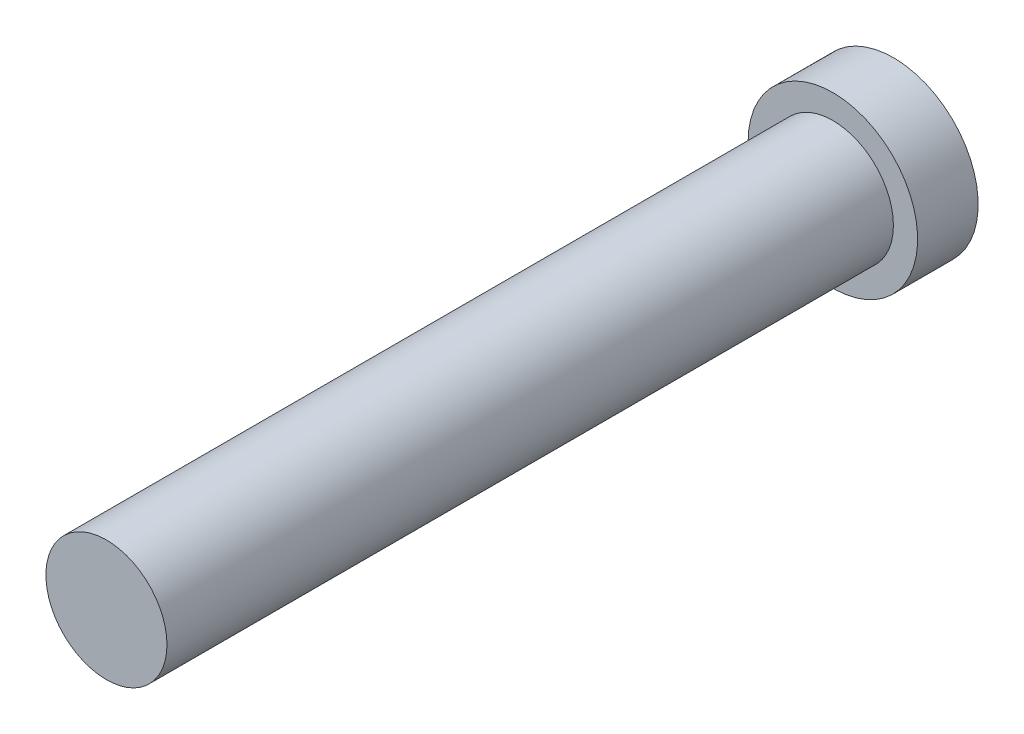
ISO-10303-21;
HEADER;
FILE_DESCRIPTION(('STEP AP214'),'2;1');
FILE_NAME('part.step','',(''),(''),'','','');
FILE_SCHEMA(('AUTOMOTIVE_DESIGN { 1 0 10303 214 1 1 1 1 }'));
ENDSEC;
DATA;
#1=APPLICATION_CONTEXT('core data for automotive mechanical design processes');
#2=APPLICATION_PROTOCOL_DEFINITION('international standard','automotive_design',2000,#1);
#3=PRODUCT_CONTEXT('',#1,'mechanical');
#4=PRODUCT('Part','Part','',(#3));
#5=PRODUCT_RELATED_PRODUCT_CATEGORY('part','',(#4));
#6=PRODUCT_DEFINITION_FORMATION('','',#4);
#7=PRODUCT_DEFINITION_CONTEXT('part definition',#1,'design');
#8=PRODUCT_DEFINITION('design','',#6,#7);
#9=PRODUCT_DEFINITION_SHAPE('','',#8);
#10=(LENGTH_UNIT() NAMED_UNIT(*) SI_UNIT(.MILLI.,.METRE.));
#11=(NAMED_UNIT(*) PLANE_ANGLE_UNIT() SI_UNIT($,.RADIAN.));
#12=(NAMED_UNIT(*) SI_UNIT($,.STERADIAN.) SOLID_ANGLE_UNIT());
#13=UNCERTAINTY_MEASURE_WITH_UNIT(LENGTH_MEASURE(1.E-05),#10,'distance_accuracy_value','');
#14=(GEOMETRIC_REPRESENTATION_CONTEXT(3) GLOBAL_UNCERTAINTY_ASSIGNED_CONTEXT((#13)) GLOBAL_UNIT_ASSIGNED_CONTEXT((#10,
#11,#12)) REPRESENTATION_CONTEXT('',''));
#15=CARTESIAN_POINT('',(0.,0.,0.));
#16=DIRECTION('',(0.,0.,1.));
#17=DIRECTION('',(1.,0.,0.));
#18=AXIS2_PLACEMENT_3D('',#15,#16,#17);
#19=CARTESIAN_POINT('',(0.,0.,30.));
#20=DIRECTION('',(0.,0.,-1.));
#21=DIRECTION('',(-1.,0.,0.));
#22=AXIS2_PLACEMENT_3D('',#19,#20,#21);
#23=CYLINDRICAL_SURFACE('',#22,2.5);
#24=CARTESIAN_POINT('',(0.,0.,30.));
#25=DIRECTION('',(0.,0.,1.));
#26=DIRECTION('',(1.,0.,0.));
#27=AXIS2_PLACEMENT_3D('',#24,#25,#26);
#28=CIRCLE('',#27,2.5);
#29=CARTESIAN_POINT('',(2.5,0.,30.));
#30=VERTEX_POINT('',#29);
#31=EDGE_CURVE('E10',#30,#30,#28,.T.);
#32=ORIENTED_EDGE('',*,*,#31,.F.);
#33=EDGE_LOOP('',(#32));
#34=FACE_BOUND('',#33,.T.);
#35=CARTESIAN_POINT('',(0.,0.,0.));
#36=DIRECTION('',(0.,0.,1.));
#37=DIRECTION('',(1.,0.,0.));
#38=AXIS2_PLACEMENT_3D('',#35,#36,#37);
#39=CIRCLE('',#38,2.5);
#40=CARTESIAN_POINT('',(2.5,0.,0.));
#41=VERTEX_POINT('',#40);
#42=EDGE_CURVE('E38',#41,#41,#39,.T.);
#43=ORIENTED_EDGE('',*,*,#42,.T.);
#44=EDGE_LOOP('',(#43));
#45=FACE_BOUND('',#44,.T.);
#46=ADVANCED_FACE('F35',(#34,#45),#23,.T.);
#47=CARTESIAN_POINT('',(0.,0.,30.));
#48=DIRECTION('',(0.,0.,1.));
#49=DIRECTION('',(1.,0.,0.));
#50=AXIS2_PLACEMENT_3D('',#47,#48,#49);
#51=PLANE('',#50);
#52=ORIENTED_EDGE('',*,*,#31,.T.);
#53=EDGE_LOOP('',(#52));
#54=FACE_BOUND('',#53,.T.);
#55=ADVANCED_FACE('F58',(#54),#51,.T.);
#56=CARTESIAN_POINT('',(0.,0.,-2.5));
#57=DIRECTION('',(0.,0.,1.));
#58=DIRECTION('',(1.,0.,0.));
#59=AXIS2_PLACEMENT_3D('',#56,#57,#58);
#60=CYLINDRICAL_SURFACE('',#59,3.49999999999984);
#61=CARTESIAN_POINT('',(0.,0.,-2.5));
#62=DIRECTION('',(0.,0.,-1.));
#63=DIRECTION('',(-1.,0.,0.));
#64=AXIS2_PLACEMENT_3D('',#61,#62,#63);
#65=CIRCLE('',#64,3.49999999999984);
#66=CARTESIAN_POINT('',(-3.49999999999984,0.,-2.5));
#67=VERTEX_POINT('',#66);
#68=EDGE_CURVE('E45',#67,#67,#65,.T.);
#69=ORIENTED_EDGE('',*,*,#68,.F.);
#70=EDGE_LOOP('',(#69));
#71=FACE_BOUND('',#70,.T.);
#72=CARTESIAN_POINT('',(0.,0.,0.));
#73=DIRECTION('',(0.,0.,-1.));
#74=DIRECTION('',(-1.,0.,0.));
#75=AXIS2_PLACEMENT_3D('',#72,#73,#74);
#76=CIRCLE('',#75,3.49999999999984);
#77=CARTESIAN_POINT('',(-3.49999999999984,0.,0.));
#78=VERTEX_POINT('',#77);
#79=EDGE_CURVE('E47',#78,#78,#76,.T.);
#80=ORIENTED_EDGE('',*,*,#79,.T.);
#81=EDGE_LOOP('',(#80));
#82=FACE_BOUND('',#81,.T.);
#83=ADVANCED_FACE('F55',(#71,#82),#60,.T.);
#84=CARTESIAN_POINT('',(0.,0.,-2.5));
#85=DIRECTION('',(0.,0.,-1.));
#86=DIRECTION('',(-1.,0.,0.));
#87=AXIS2_PLACEMENT_3D('',#84,#85,#86);
#88=PLANE('',#87);
#89=ORIENTED_EDGE('',*,*,#68,.T.);
#90=EDGE_LOOP('',(#89));
#91=FACE_BOUND('',#90,.T.);
#92=ADVANCED_FACE('F53',(#91),#88,.T.);
#93=CARTESIAN_POINT('',(0.,0.,0.));
#94=DIRECTION('',(0.,0.,-1.));
#95=DIRECTION('',(-1.,0.,0.));
#96=AXIS2_PLACEMENT_3D('',#93,#94,#95);
#97=PLANE('',#96);
#98=ORIENTED_EDGE('',*,*,#42,.F.);
#99=EDGE_LOOP('',(#98));
#100=FACE_BOUND('',#99,.T.);
#101=ORIENTED_EDGE('',*,*,#79,.F.);
#102=EDGE_LOOP('',(#101));
#103=FACE_BOUND('',#102,.T.);
#104=ADVANCED_FACE('F62',(#100,#103),#97,.F.);
#105=CLOSED_SHELL('',(#46,#55,#83,#92,#104));
#106=MANIFOLD_SOLID_BREP('B2',#105);
#107=ADVANCED_BREP_SHAPE_REPRESENTATION('',(#18,#106),#14);
#108=SHAPE_DEFINITION_REPRESENTATION(#9,#107);
ENDSEC;
END-ISO-10303-21;
